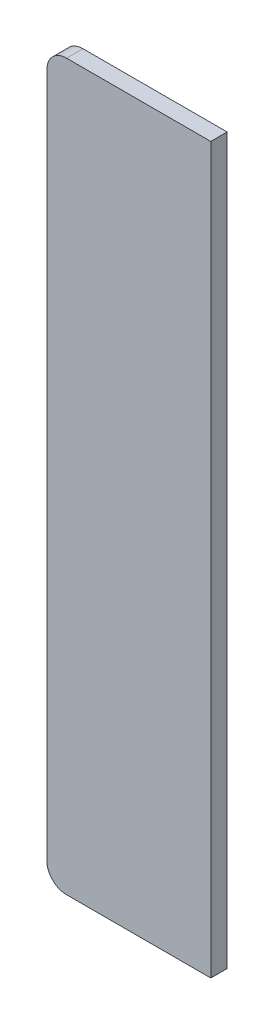
ISO-10303-21;
HEADER;
FILE_DESCRIPTION(('STEP AP214'),'2;1');
FILE_NAME('part.step','',(''),(''),'','','');
FILE_SCHEMA(('AUTOMOTIVE_DESIGN { 1 0 10303 214 1 1 1 1 }'));
ENDSEC;
DATA;
#1=APPLICATION_CONTEXT('core data for automotive mechanical design processes');
#2=APPLICATION_PROTOCOL_DEFINITION('international standard','automotive_design',2000,#1);
#3=PRODUCT_CONTEXT('',#1,'mechanical');
#4=PRODUCT('Part','Part','',(#3));
#5=PRODUCT_RELATED_PRODUCT_CATEGORY('part','',(#4));
#6=PRODUCT_DEFINITION_FORMATION('','',#4);
#7=PRODUCT_DEFINITION_CONTEXT('part definition',#1,'design');
#8=PRODUCT_DEFINITION('design','',#6,#7);
#9=PRODUCT_DEFINITION_SHAPE('','',#8);
#10=(LENGTH_UNIT() NAMED_UNIT(*) SI_UNIT(.MILLI.,.METRE.));
#11=(NAMED_UNIT(*) PLANE_ANGLE_UNIT() SI_UNIT($,.RADIAN.));
#12=(NAMED_UNIT(*) SI_UNIT($,.STERADIAN.) SOLID_ANGLE_UNIT());
#13=UNCERTAINTY_MEASURE_WITH_UNIT(LENGTH_MEASURE(1.E-05),#10,'distance_accuracy_value','');
#14=(GEOMETRIC_REPRESENTATION_CONTEXT(3) GLOBAL_UNCERTAINTY_ASSIGNED_CONTEXT((#13)) GLOBAL_UNIT_ASSIGNED_CONTEXT((#10,
#11,#12)) REPRESENTATION_CONTEXT('',''));
#15=CARTESIAN_POINT('',(0.,0.,0.));
#16=DIRECTION('',(0.,0.,1.));
#17=DIRECTION('',(1.,0.,0.));
#18=AXIS2_PLACEMENT_3D('',#15,#16,#17);
#19=CARTESIAN_POINT('',(30.,30.,25.));
#20=DIRECTION('',(0.,0.,1.));
#21=DIRECTION('',(1.,0.,0.));
#22=AXIS2_PLACEMENT_3D('',#19,#20,#21);
#23=CYLINDRICAL_SURFACE('',#22,30.);
#24=DIRECTION('',(0.,0.,1.));
#25=VECTOR('',#24,1.);
#26=CARTESIAN_POINT('',(0.,30.,25.));
#27=LINE('',#26,#25);
#28=CARTESIAN_POINT('',(0.,30.,0.));
#29=VERTEX_POINT('',#28);
#30=CARTESIAN_POINT('',(0.,30.,25.));
#31=VERTEX_POINT('',#30);
#32=EDGE_CURVE('E151',#29,#31,#27,.T.);
#33=ORIENTED_EDGE('',*,*,#32,.F.);
#34=CARTESIAN_POINT('',(30.,30.,0.));
#35=DIRECTION('',(0.,0.,-1.));
#36=DIRECTION('',(-1.,0.,0.));
#37=AXIS2_PLACEMENT_3D('',#34,#35,#36);
#38=CIRCLE('',#37,30.);
#39=CARTESIAN_POINT('',(30.,0.,0.));
#40=VERTEX_POINT('',#39);
#41=EDGE_CURVE('E51',#40,#29,#38,.T.);
#42=ORIENTED_EDGE('',*,*,#41,.F.);
#43=DIRECTION('',(0.,0.,1.));
#44=VECTOR('',#43,1.);
#45=CARTESIAN_POINT('',(30.,0.,25.));
#46=LINE('',#45,#44);
#47=CARTESIAN_POINT('',(30.,0.,25.));
#48=VERTEX_POINT('',#47);
#49=EDGE_CURVE('E155',#48,#40,#46,.F.);
#50=ORIENTED_EDGE('',*,*,#49,.F.);
#51=CARTESIAN_POINT('',(30.,30.,25.));
#52=DIRECTION('',(0.,0.,-1.));
#53=DIRECTION('',(-1.,0.,0.));
#54=AXIS2_PLACEMENT_3D('',#51,#52,#53);
#55=CIRCLE('',#54,30.);
#56=EDGE_CURVE('E11',#31,#48,#55,.F.);
#57=ORIENTED_EDGE('',*,*,#56,.F.);
#58=EDGE_LOOP('',(#33,#42,#50,#57));
#59=FACE_BOUND('',#58,.T.);
#60=ADVANCED_FACE('F43',(#59),#23,.T.);
#61=CARTESIAN_POINT('',(30.,1075.,25.));
#62=DIRECTION('',(0.,0.,1.));
#63=DIRECTION('',(1.,0.,0.));
#64=AXIS2_PLACEMENT_3D('',#61,#62,#63);
#65=CYLINDRICAL_SURFACE('',#64,30.);
#66=DIRECTION('',(0.,0.,1.));
#67=VECTOR('',#66,1.);
#68=CARTESIAN_POINT('',(30.,1105.,25.));
#69=LINE('',#68,#67);
#70=CARTESIAN_POINT('',(30.,1105.,0.));
#71=VERTEX_POINT('',#70);
#72=CARTESIAN_POINT('',(30.,1105.,25.));
#73=VERTEX_POINT('',#72);
#74=EDGE_CURVE('E110',#71,#73,#69,.T.);
#75=ORIENTED_EDGE('',*,*,#74,.F.);
#76=CARTESIAN_POINT('',(30.,1075.,0.));
#77=DIRECTION('',(0.,0.,-1.));
#78=DIRECTION('',(-1.,0.,0.));
#79=AXIS2_PLACEMENT_3D('',#76,#77,#78);
#80=CIRCLE('',#79,30.);
#81=CARTESIAN_POINT('',(0.,1075.,0.));
#82=VERTEX_POINT('',#81);
#83=EDGE_CURVE('E145',#82,#71,#80,.T.);
#84=ORIENTED_EDGE('',*,*,#83,.F.);
#85=DIRECTION('',(0.,0.,1.));
#86=VECTOR('',#85,1.);
#87=CARTESIAN_POINT('',(0.,1075.,25.));
#88=LINE('',#87,#86);
#89=CARTESIAN_POINT('',(0.,1075.,25.));
#90=VERTEX_POINT('',#89);
#91=EDGE_CURVE('E141',#90,#82,#88,.F.);
#92=ORIENTED_EDGE('',*,*,#91,.F.);
#93=CARTESIAN_POINT('',(30.,1075.,25.));
#94=DIRECTION('',(0.,0.,-1.));
#95=DIRECTION('',(-1.,0.,0.));
#96=AXIS2_PLACEMENT_3D('',#93,#94,#95);
#97=CIRCLE('',#96,30.);
#98=EDGE_CURVE('E148',#73,#90,#97,.F.);
#99=ORIENTED_EDGE('',*,*,#98,.F.);
#100=EDGE_LOOP('',(#75,#84,#92,#99));
#101=FACE_BOUND('',#100,.T.);
#102=ADVANCED_FACE('F167',(#101),#65,.T.);
#103=CARTESIAN_POINT('',(0.,0.,25.));
#104=DIRECTION('',(1.,0.,0.));
#105=DIRECTION('',(0.,0.,-1.));
#106=AXIS2_PLACEMENT_3D('',#103,#104,#105);
#107=PLANE('',#106);
#108=DIRECTION('',(0.,-1.,0.));
#109=VECTOR('',#108,1.);
#110=CARTESIAN_POINT('',(0.,0.,0.));
#111=LINE('',#110,#109);
#112=EDGE_CURVE('E123',#82,#29,#111,.T.);
#113=ORIENTED_EDGE('',*,*,#112,.T.);
#114=ORIENTED_EDGE('',*,*,#32,.T.);
#115=DIRECTION('',(0.,-1.,0.));
#116=VECTOR('',#115,1.);
#117=CARTESIAN_POINT('',(0.,0.,25.));
#118=LINE('',#117,#116);
#119=EDGE_CURVE('E100',#90,#31,#118,.T.);
#120=ORIENTED_EDGE('',*,*,#119,.F.);
#121=ORIENTED_EDGE('',*,*,#91,.T.);
#122=EDGE_LOOP('',(#113,#114,#120,#121));
#123=FACE_BOUND('',#122,.T.);
#124=ADVANCED_FACE('F163',(#123),#107,.F.);
#125=CARTESIAN_POINT('',(0.,0.,25.));
#126=DIRECTION('',(0.,1.,0.));
#127=DIRECTION('',(0.,0.,1.));
#128=AXIS2_PLACEMENT_3D('',#125,#126,#127);
#129=PLANE('',#128);
#130=DIRECTION('',(1.,0.,0.));
#131=VECTOR('',#130,1.);
#132=CARTESIAN_POINT('',(0.,0.,25.));
#133=LINE('',#132,#131);
#134=CARTESIAN_POINT('',(250.,0.,25.));
#135=VERTEX_POINT('',#134);
#136=EDGE_CURVE('E91',#48,#135,#133,.T.);
#137=ORIENTED_EDGE('',*,*,#136,.F.);
#138=ORIENTED_EDGE('',*,*,#49,.T.);
#139=DIRECTION('',(1.,0.,0.));
#140=VECTOR('',#139,1.);
#141=CARTESIAN_POINT('',(0.,0.,0.));
#142=LINE('',#141,#140);
#143=CARTESIAN_POINT('',(250.,0.,0.));
#144=VERTEX_POINT('',#143);
#145=EDGE_CURVE('E106',#40,#144,#142,.T.);
#146=ORIENTED_EDGE('',*,*,#145,.T.);
#147=DIRECTION('',(0.,0.,-1.));
#148=VECTOR('',#147,1.);
#149=CARTESIAN_POINT('',(250.,0.,25.));
#150=LINE('',#149,#148);
#151=EDGE_CURVE('E103',#135,#144,#150,.T.);
#152=ORIENTED_EDGE('',*,*,#151,.F.);
#153=EDGE_LOOP('',(#137,#138,#146,#152));
#154=FACE_BOUND('',#153,.T.);
#155=ADVANCED_FACE('F104',(#154),#129,.F.);
#156=CARTESIAN_POINT('',(250.,0.,25.));
#157=DIRECTION('',(-1.,0.,0.));
#158=DIRECTION('',(0.,0.,1.));
#159=AXIS2_PLACEMENT_3D('',#156,#157,#158);
#160=PLANE('',#159);
#161=DIRECTION('',(0.,1.,0.));
#162=VECTOR('',#161,1.);
#163=CARTESIAN_POINT('',(250.,0.,0.));
#164=LINE('',#163,#162);
#165=CARTESIAN_POINT('',(250.,1105.,0.));
#166=VERTEX_POINT('',#165);
#167=EDGE_CURVE('E129',#144,#166,#164,.T.);
#168=ORIENTED_EDGE('',*,*,#167,.T.);
#169=DIRECTION('',(0.,0.,-1.));
#170=VECTOR('',#169,1.);
#171=CARTESIAN_POINT('',(250.,1105.,25.));
#172=LINE('',#171,#170);
#173=CARTESIAN_POINT('',(250.,1105.,25.));
#174=VERTEX_POINT('',#173);
#175=EDGE_CURVE('E111',#174,#166,#172,.T.);
#176=ORIENTED_EDGE('',*,*,#175,.F.);
#177=DIRECTION('',(0.,1.,0.));
#178=VECTOR('',#177,1.);
#179=CARTESIAN_POINT('',(250.,0.,25.));
#180=LINE('',#179,#178);
#181=EDGE_CURVE('E96',#135,#174,#180,.T.);
#182=ORIENTED_EDGE('',*,*,#181,.F.);
#183=ORIENTED_EDGE('',*,*,#151,.T.);
#184=EDGE_LOOP('',(#168,#176,#182,#183));
#185=FACE_BOUND('',#184,.T.);
#186=ADVANCED_FACE('F113',(#185),#160,.F.);
#187=CARTESIAN_POINT('',(0.,1105.,25.));
#188=DIRECTION('',(0.,-1.,0.));
#189=DIRECTION('',(0.,0.,-1.));
#190=AXIS2_PLACEMENT_3D('',#187,#188,#189);
#191=PLANE('',#190);
#192=DIRECTION('',(-1.,0.,0.));
#193=VECTOR('',#192,1.);
#194=CARTESIAN_POINT('',(0.,1105.,0.));
#195=LINE('',#194,#193);
#196=EDGE_CURVE('E132',#166,#71,#195,.T.);
#197=ORIENTED_EDGE('',*,*,#196,.T.);
#198=ORIENTED_EDGE('',*,*,#74,.T.);
#199=DIRECTION('',(-1.,0.,0.));
#200=VECTOR('',#199,1.);
#201=CARTESIAN_POINT('',(0.,1105.,25.));
#202=LINE('',#201,#200);
#203=EDGE_CURVE('E117',#174,#73,#202,.T.);
#204=ORIENTED_EDGE('',*,*,#203,.F.);
#205=ORIENTED_EDGE('',*,*,#175,.T.);
#206=EDGE_LOOP('',(#197,#198,#204,#205));
#207=FACE_BOUND('',#206,.T.);
#208=ADVANCED_FACE('F170',(#207),#191,.F.);
#209=CARTESIAN_POINT('',(0.,0.,25.));
#210=DIRECTION('',(0.,0.,-1.));
#211=DIRECTION('',(-1.,0.,0.));
#212=AXIS2_PLACEMENT_3D('',#209,#210,#211);
#213=PLANE('',#212);
#214=ORIENTED_EDGE('',*,*,#119,.T.);
#215=ORIENTED_EDGE('',*,*,#56,.T.);
#216=ORIENTED_EDGE('',*,*,#136,.T.);
#217=ORIENTED_EDGE('',*,*,#181,.T.);
#218=ORIENTED_EDGE('',*,*,#203,.T.);
#219=ORIENTED_EDGE('',*,*,#98,.T.);
#220=EDGE_LOOP('',(#214,#215,#216,#217,#218,#219));
#221=FACE_BOUND('',#220,.T.);
#222=ADVANCED_FACE('F93',(#221),#213,.F.);
#223=CARTESIAN_POINT('',(0.,0.,0.));
#224=DIRECTION('',(0.,0.,-1.));
#225=DIRECTION('',(-1.,0.,0.));
#226=AXIS2_PLACEMENT_3D('',#223,#224,#225);
#227=PLANE('',#226);
#228=ORIENTED_EDGE('',*,*,#145,.F.);
#229=ORIENTED_EDGE('',*,*,#41,.T.);
#230=ORIENTED_EDGE('',*,*,#112,.F.);
#231=ORIENTED_EDGE('',*,*,#83,.T.);
#232=ORIENTED_EDGE('',*,*,#196,.F.);
#233=ORIENTED_EDGE('',*,*,#167,.F.);
#234=EDGE_LOOP('',(#228,#229,#230,#231,#232,#233));
#235=FACE_BOUND('',#234,.T.);
#236=ADVANCED_FACE('F160',(#235),#227,.T.);
#237=CLOSED_SHELL('',(#60,#102,#124,#155,#186,#208,#222,#236));
#238=MANIFOLD_SOLID_BREP('B2',#237);
#239=ADVANCED_BREP_SHAPE_REPRESENTATION('',(#18,#238),#14);
#240=SHAPE_DEFINITION_REPRESENTATION(#9,#239);
ENDSEC;
END-ISO-10303-21;
